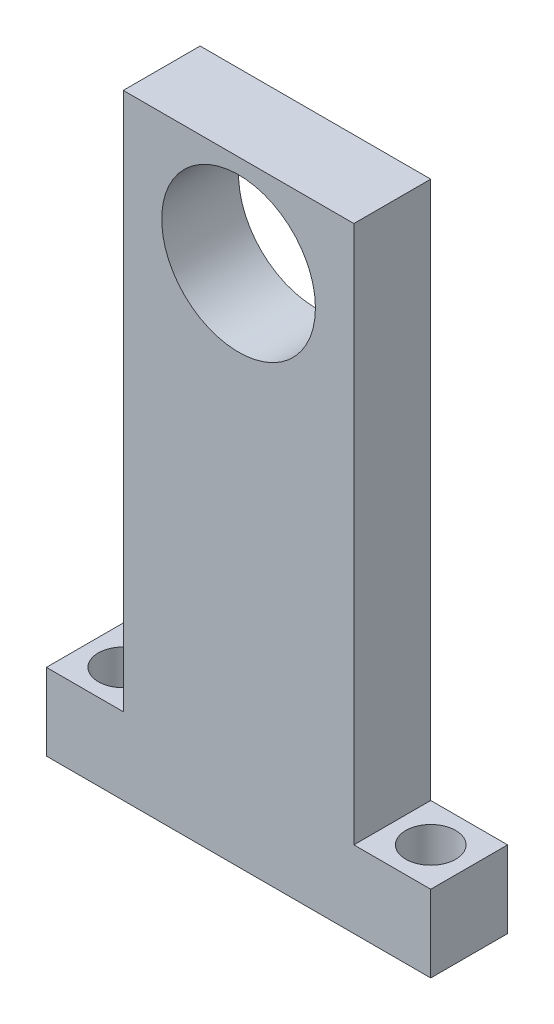
ISO-10303-21;
HEADER;
FILE_DESCRIPTION(('STEP AP214'),'2;1');
FILE_NAME('part.step','',(''),(''),'','','');
FILE_SCHEMA(('AUTOMOTIVE_DESIGN { 1 0 10303 214 1 1 1 1 }'));
ENDSEC;
DATA;
#1=APPLICATION_CONTEXT('core data for automotive mechanical design processes');
#2=APPLICATION_PROTOCOL_DEFINITION('international standard','automotive_design',2000,#1);
#3=PRODUCT_CONTEXT('',#1,'mechanical');
#4=PRODUCT('Part','Part','',(#3));
#5=PRODUCT_RELATED_PRODUCT_CATEGORY('part','',(#4));
#6=PRODUCT_DEFINITION_FORMATION('','',#4);
#7=PRODUCT_DEFINITION_CONTEXT('part definition',#1,'design');
#8=PRODUCT_DEFINITION('design','',#6,#7);
#9=PRODUCT_DEFINITION_SHAPE('','',#8);
#10=(LENGTH_UNIT() NAMED_UNIT(*) SI_UNIT(.MILLI.,.METRE.));
#11=(NAMED_UNIT(*) PLANE_ANGLE_UNIT() SI_UNIT($,.RADIAN.));
#12=(NAMED_UNIT(*) SI_UNIT($,.STERADIAN.) SOLID_ANGLE_UNIT());
#13=UNCERTAINTY_MEASURE_WITH_UNIT(LENGTH_MEASURE(1.E-05),#10,'distance_accuracy_value','');
#14=(GEOMETRIC_REPRESENTATION_CONTEXT(3) GLOBAL_UNCERTAINTY_ASSIGNED_CONTEXT((#13)) GLOBAL_UNIT_ASSIGNED_CONTEXT((#10,
#11,#12)) REPRESENTATION_CONTEXT('',''));
#15=CARTESIAN_POINT('',(0.,0.,0.));
#16=DIRECTION('',(0.,0.,1.));
#17=DIRECTION('',(1.,0.,0.));
#18=AXIS2_PLACEMENT_3D('',#15,#16,#17);
#19=CARTESIAN_POINT('',(-15.,40.,5.));
#20=DIRECTION('',(1.,0.,0.));
#21=DIRECTION('',(0.,0.,-1.));
#22=AXIS2_PLACEMENT_3D('',#19,#20,#21);
#23=PLANE('',#22);
#24=DIRECTION('',(0.,0.,-1.));
#25=VECTOR('',#24,1.);
#26=CARTESIAN_POINT('',(-15.,-30.,5.));
#27=LINE('',#26,#25);
#28=CARTESIAN_POINT('',(-15.,-30.,5.));
#29=VERTEX_POINT('',#28);
#30=CARTESIAN_POINT('',(-15.,-30.,-5.));
#31=VERTEX_POINT('',#30);
#32=EDGE_CURVE('E48',#29,#31,#27,.T.);
#33=ORIENTED_EDGE('',*,*,#32,.F.);
#34=DIRECTION('',(0.,-1.,0.));
#35=VECTOR('',#34,1.);
#36=CARTESIAN_POINT('',(-15.,40.,5.));
#37=LINE('',#36,#35);
#38=CARTESIAN_POINT('',(-15.,40.,5.));
#39=VERTEX_POINT('',#38);
#40=EDGE_CURVE('E123',#39,#29,#37,.T.);
#41=ORIENTED_EDGE('',*,*,#40,.F.);
#42=DIRECTION('',(0.,0.,-1.));
#43=VECTOR('',#42,1.);
#44=CARTESIAN_POINT('',(-15.,40.,5.));
#45=LINE('',#44,#43);
#46=CARTESIAN_POINT('',(-15.,40.,-5.));
#47=VERTEX_POINT('',#46);
#48=EDGE_CURVE('E41',#39,#47,#45,.T.);
#49=ORIENTED_EDGE('',*,*,#48,.T.);
#50=DIRECTION('',(0.,-1.,0.));
#51=VECTOR('',#50,1.);
#52=CARTESIAN_POINT('',(-15.,40.,-5.));
#53=LINE('',#52,#51);
#54=EDGE_CURVE('E174',#47,#31,#53,.T.);
#55=ORIENTED_EDGE('',*,*,#54,.T.);
#56=EDGE_LOOP('',(#33,#41,#49,#55));
#57=FACE_BOUND('',#56,.T.);
#58=ADVANCED_FACE('F33',(#57),#23,.F.);
#59=CARTESIAN_POINT('',(0.,0.,5.));
#60=DIRECTION('',(0.,0.,1.));
#61=DIRECTION('',(1.,0.,0.));
#62=AXIS2_PLACEMENT_3D('',#59,#60,#61);
#63=PLANE('',#62);
#64=DIRECTION('',(1.,0.,0.));
#65=VECTOR('',#64,1.);
#66=CARTESIAN_POINT('',(-15.,-40.,5.));
#67=LINE('',#66,#65);
#68=CARTESIAN_POINT('',(-25.,-40.,5.));
#69=VERTEX_POINT('',#68);
#70=CARTESIAN_POINT('',(25.,-40.,5.));
#71=VERTEX_POINT('',#70);
#72=EDGE_CURVE('E169',#69,#71,#67,.T.);
#73=ORIENTED_EDGE('',*,*,#72,.T.);
#74=DIRECTION('',(0.,-1.,0.));
#75=VECTOR('',#74,1.);
#76=CARTESIAN_POINT('',(25.,-30.,5.));
#77=LINE('',#76,#75);
#78=CARTESIAN_POINT('',(25.,-30.,5.));
#79=VERTEX_POINT('',#78);
#80=EDGE_CURVE('E151',#79,#71,#77,.T.);
#81=ORIENTED_EDGE('',*,*,#80,.F.);
#82=DIRECTION('',(-1.,0.,0.));
#83=VECTOR('',#82,1.);
#84=CARTESIAN_POINT('',(15.,-30.,5.));
#85=LINE('',#84,#83);
#86=CARTESIAN_POINT('',(15.,-30.,5.));
#87=VERTEX_POINT('',#86);
#88=EDGE_CURVE('E145',#79,#87,#85,.T.);
#89=ORIENTED_EDGE('',*,*,#88,.T.);
#90=DIRECTION('',(0.,1.,0.));
#91=VECTOR('',#90,1.);
#92=CARTESIAN_POINT('',(15.,40.,5.));
#93=LINE('',#92,#91);
#94=CARTESIAN_POINT('',(15.,40.,5.));
#95=VERTEX_POINT('',#94);
#96=EDGE_CURVE('E163',#87,#95,#93,.T.);
#97=ORIENTED_EDGE('',*,*,#96,.T.);
#98=DIRECTION('',(-1.,0.,0.));
#99=VECTOR('',#98,1.);
#100=CARTESIAN_POINT('',(-15.,40.,5.));
#101=LINE('',#100,#99);
#102=EDGE_CURVE('E165',#95,#39,#101,.T.);
#103=ORIENTED_EDGE('',*,*,#102,.T.);
#104=ORIENTED_EDGE('',*,*,#40,.T.);
#105=DIRECTION('',(1.,0.,0.));
#106=VECTOR('',#105,1.);
#107=CARTESIAN_POINT('',(-15.,-30.,5.));
#108=LINE('',#107,#106);
#109=CARTESIAN_POINT('',(-25.,-30.,5.));
#110=VERTEX_POINT('',#109);
#111=EDGE_CURVE('E105',#110,#29,#108,.T.);
#112=ORIENTED_EDGE('',*,*,#111,.F.);
#113=DIRECTION('',(0.,-1.,0.));
#114=VECTOR('',#113,1.);
#115=CARTESIAN_POINT('',(-25.,-30.,5.));
#116=LINE('',#115,#114);
#117=EDGE_CURVE('E114',#110,#69,#116,.T.);
#118=ORIENTED_EDGE('',*,*,#117,.T.);
#119=EDGE_LOOP('',(#73,#81,#89,#97,#103,#104,#112,#118));
#120=FACE_BOUND('',#119,.T.);
#121=CARTESIAN_POINT('',(0.,28.,5.));
#122=DIRECTION('',(0.,0.,1.));
#123=DIRECTION('',(1.,0.,0.));
#124=AXIS2_PLACEMENT_3D('',#121,#122,#123);
#125=CIRCLE('',#124,10.);
#126=CARTESIAN_POINT('',(10.,28.,5.));
#127=VERTEX_POINT('',#126);
#128=EDGE_CURVE('E157',#127,#127,#125,.T.);
#129=ORIENTED_EDGE('',*,*,#128,.F.);
#130=EDGE_LOOP('',(#129));
#131=FACE_BOUND('',#130,.T.);
#132=ADVANCED_FACE('F121',(#120,#131),#63,.T.);
#133=CARTESIAN_POINT('',(0.,0.,-5.));
#134=DIRECTION('',(0.,0.,1.));
#135=DIRECTION('',(1.,0.,0.));
#136=AXIS2_PLACEMENT_3D('',#133,#134,#135);
#137=PLANE('',#136);
#138=DIRECTION('',(0.,1.,0.));
#139=VECTOR('',#138,1.);
#140=CARTESIAN_POINT('',(15.,40.,-5.));
#141=LINE('',#140,#139);
#142=CARTESIAN_POINT('',(15.,-30.,-5.));
#143=VERTEX_POINT('',#142);
#144=CARTESIAN_POINT('',(15.,40.,-5.));
#145=VERTEX_POINT('',#144);
#146=EDGE_CURVE('E160',#143,#145,#141,.T.);
#147=ORIENTED_EDGE('',*,*,#146,.F.);
#148=DIRECTION('',(1.,0.,0.));
#149=VECTOR('',#148,1.);
#150=CARTESIAN_POINT('',(15.,-30.,-5.));
#151=LINE('',#150,#149);
#152=CARTESIAN_POINT('',(25.,-30.,-5.));
#153=VERTEX_POINT('',#152);
#154=EDGE_CURVE('E56',#143,#153,#151,.T.);
#155=ORIENTED_EDGE('',*,*,#154,.T.);
#156=DIRECTION('',(0.,-1.,0.));
#157=VECTOR('',#156,1.);
#158=CARTESIAN_POINT('',(25.,-30.,-5.));
#159=LINE('',#158,#157);
#160=CARTESIAN_POINT('',(25.,-40.,-5.));
#161=VERTEX_POINT('',#160);
#162=EDGE_CURVE('E148',#153,#161,#159,.T.);
#163=ORIENTED_EDGE('',*,*,#162,.T.);
#164=DIRECTION('',(1.,0.,0.));
#165=VECTOR('',#164,1.);
#166=CARTESIAN_POINT('',(-15.,-40.,-5.));
#167=LINE('',#166,#165);
#168=CARTESIAN_POINT('',(-25.,-40.,-5.));
#169=VERTEX_POINT('',#168);
#170=EDGE_CURVE('E166',#169,#161,#167,.T.);
#171=ORIENTED_EDGE('',*,*,#170,.F.);
#172=DIRECTION('',(0.,-1.,0.));
#173=VECTOR('',#172,1.);
#174=CARTESIAN_POINT('',(-25.,-30.,-5.));
#175=LINE('',#174,#173);
#176=CARTESIAN_POINT('',(-25.,-30.,-5.));
#177=VERTEX_POINT('',#176);
#178=EDGE_CURVE('E119',#177,#169,#175,.T.);
#179=ORIENTED_EDGE('',*,*,#178,.F.);
#180=DIRECTION('',(-1.,0.,0.));
#181=VECTOR('',#180,1.);
#182=CARTESIAN_POINT('',(-15.,-30.,-5.));
#183=LINE('',#182,#181);
#184=EDGE_CURVE('E107',#31,#177,#183,.T.);
#185=ORIENTED_EDGE('',*,*,#184,.F.);
#186=ORIENTED_EDGE('',*,*,#54,.F.);
#187=DIRECTION('',(-1.,0.,0.));
#188=VECTOR('',#187,1.);
#189=CARTESIAN_POINT('',(-15.,40.,-5.));
#190=LINE('',#189,#188);
#191=EDGE_CURVE('E172',#145,#47,#190,.T.);
#192=ORIENTED_EDGE('',*,*,#191,.F.);
#193=EDGE_LOOP('',(#147,#155,#163,#171,#179,#185,#186,#192));
#194=FACE_BOUND('',#193,.T.);
#195=CARTESIAN_POINT('',(0.,28.,-5.));
#196=DIRECTION('',(0.,0.,1.));
#197=DIRECTION('',(1.,0.,0.));
#198=AXIS2_PLACEMENT_3D('',#195,#196,#197);
#199=CIRCLE('',#198,10.);
#200=CARTESIAN_POINT('',(10.,28.,-5.));
#201=VERTEX_POINT('',#200);
#202=EDGE_CURVE('E154',#201,#201,#199,.T.);
#203=ORIENTED_EDGE('',*,*,#202,.T.);
#204=EDGE_LOOP('',(#203));
#205=FACE_BOUND('',#204,.T.);
#206=ADVANCED_FACE('F184',(#194,#205),#137,.F.);
#207=CARTESIAN_POINT('',(15.,40.,5.));
#208=DIRECTION('',(-1.,0.,0.));
#209=DIRECTION('',(0.,0.,1.));
#210=AXIS2_PLACEMENT_3D('',#207,#208,#209);
#211=PLANE('',#210);
#212=ORIENTED_EDGE('',*,*,#96,.F.);
#213=DIRECTION('',(0.,0.,-1.));
#214=VECTOR('',#213,1.);
#215=CARTESIAN_POINT('',(15.,-30.,5.));
#216=LINE('',#215,#214);
#217=EDGE_CURVE('E139',#87,#143,#216,.T.);
#218=ORIENTED_EDGE('',*,*,#217,.T.);
#219=ORIENTED_EDGE('',*,*,#146,.T.);
#220=DIRECTION('',(0.,0.,-1.));
#221=VECTOR('',#220,1.);
#222=CARTESIAN_POINT('',(15.,40.,5.));
#223=LINE('',#222,#221);
#224=EDGE_CURVE('E11',#95,#145,#223,.T.);
#225=ORIENTED_EDGE('',*,*,#224,.F.);
#226=EDGE_LOOP('',(#212,#218,#219,#225));
#227=FACE_BOUND('',#226,.T.);
#228=ADVANCED_FACE('F35',(#227),#211,.F.);
#229=CARTESIAN_POINT('',(-15.,40.,5.));
#230=DIRECTION('',(0.,-1.,0.));
#231=DIRECTION('',(0.,0.,-1.));
#232=AXIS2_PLACEMENT_3D('',#229,#230,#231);
#233=PLANE('',#232);
#234=ORIENTED_EDGE('',*,*,#191,.T.);
#235=ORIENTED_EDGE('',*,*,#48,.F.);
#236=ORIENTED_EDGE('',*,*,#102,.F.);
#237=ORIENTED_EDGE('',*,*,#224,.T.);
#238=EDGE_LOOP('',(#234,#235,#236,#237));
#239=FACE_BOUND('',#238,.T.);
#240=ADVANCED_FACE('F197',(#239),#233,.F.);
#241=CARTESIAN_POINT('',(-15.,-40.,5.));
#242=DIRECTION('',(0.,1.,0.));
#243=DIRECTION('',(0.,0.,1.));
#244=AXIS2_PLACEMENT_3D('',#241,#242,#243);
#245=PLANE('',#244);
#246=ORIENTED_EDGE('',*,*,#170,.T.);
#247=DIRECTION('',(0.,0.,1.));
#248=VECTOR('',#247,1.);
#249=CARTESIAN_POINT('',(25.,-40.,5.));
#250=LINE('',#249,#248);
#251=EDGE_CURVE('E136',#161,#71,#250,.T.);
#252=ORIENTED_EDGE('',*,*,#251,.T.);
#253=ORIENTED_EDGE('',*,*,#72,.F.);
#254=DIRECTION('',(0.,0.,1.));
#255=VECTOR('',#254,1.);
#256=CARTESIAN_POINT('',(-25.,-40.,5.));
#257=LINE('',#256,#255);
#258=EDGE_CURVE('E117',#169,#69,#257,.T.);
#259=ORIENTED_EDGE('',*,*,#258,.F.);
#260=EDGE_LOOP('',(#246,#252,#253,#259));
#261=FACE_BOUND('',#260,.T.);
#262=CARTESIAN_POINT('',(20.,-40.,0.));
#263=DIRECTION('',(0.,-1.,0.));
#264=DIRECTION('',(0.,0.,-1.));
#265=AXIS2_PLACEMENT_3D('',#262,#263,#264);
#266=CIRCLE('',#265,3.25);
#267=CARTESIAN_POINT('',(20.,-40.,-3.25));
#268=VERTEX_POINT('',#267);
#269=EDGE_CURVE('E131',#268,#268,#266,.T.);
#270=ORIENTED_EDGE('',*,*,#269,.F.);
#271=EDGE_LOOP('',(#270));
#272=FACE_BOUND('',#271,.T.);
#273=CARTESIAN_POINT('',(-20.,-40.,0.));
#274=DIRECTION('',(0.,1.,0.));
#275=DIRECTION('',(0.,0.,-1.));
#276=AXIS2_PLACEMENT_3D('',#273,#274,#275);
#277=CIRCLE('',#276,3.25);
#278=CARTESIAN_POINT('',(-20.,-40.,-3.25));
#279=VERTEX_POINT('',#278);
#280=EDGE_CURVE('E240',#279,#279,#277,.T.);
#281=ORIENTED_EDGE('',*,*,#280,.T.);
#282=EDGE_LOOP('',(#281));
#283=FACE_BOUND('',#282,.T.);
#284=ADVANCED_FACE('F187',(#261,#272,#283),#245,.F.);
#285=CARTESIAN_POINT('',(0.,28.,5.));
#286=DIRECTION('',(0.,0.,-1.));
#287=DIRECTION('',(-1.,0.,0.));
#288=AXIS2_PLACEMENT_3D('',#285,#286,#287);
#289=CYLINDRICAL_SURFACE('',#288,10.);
#290=ORIENTED_EDGE('',*,*,#128,.T.);
#291=EDGE_LOOP('',(#290));
#292=FACE_BOUND('',#291,.T.);
#293=ORIENTED_EDGE('',*,*,#202,.F.);
#294=EDGE_LOOP('',(#293));
#295=FACE_BOUND('',#294,.T.);
#296=ADVANCED_FACE('F203',(#292,#295),#289,.F.);
#297=CARTESIAN_POINT('',(25.,-30.,5.));
#298=DIRECTION('',(1.,0.,0.));
#299=DIRECTION('',(0.,0.,-1.));
#300=AXIS2_PLACEMENT_3D('',#297,#298,#299);
#301=PLANE('',#300);
#302=ORIENTED_EDGE('',*,*,#251,.F.);
#303=ORIENTED_EDGE('',*,*,#162,.F.);
#304=DIRECTION('',(0.,0.,1.));
#305=VECTOR('',#304,1.);
#306=CARTESIAN_POINT('',(25.,-30.,5.));
#307=LINE('',#306,#305);
#308=EDGE_CURVE('E142',#153,#79,#307,.T.);
#309=ORIENTED_EDGE('',*,*,#308,.T.);
#310=ORIENTED_EDGE('',*,*,#80,.T.);
#311=EDGE_LOOP('',(#302,#303,#309,#310));
#312=FACE_BOUND('',#311,.T.);
#313=ADVANCED_FACE('F191',(#312),#301,.T.);
#314=CARTESIAN_POINT('',(0.,-30.,0.));
#315=DIRECTION('',(0.,-1.,0.));
#316=DIRECTION('',(0.,0.,-1.));
#317=AXIS2_PLACEMENT_3D('',#314,#315,#316);
#318=PLANE('',#317);
#319=CARTESIAN_POINT('',(20.,-30.,0.));
#320=DIRECTION('',(0.,-1.,0.));
#321=DIRECTION('',(0.,0.,-1.));
#322=AXIS2_PLACEMENT_3D('',#319,#320,#321);
#323=CIRCLE('',#322,3.25);
#324=CARTESIAN_POINT('',(20.,-30.,-3.25));
#325=VERTEX_POINT('',#324);
#326=EDGE_CURVE('E133',#325,#325,#323,.T.);
#327=ORIENTED_EDGE('',*,*,#326,.T.);
#328=EDGE_LOOP('',(#327));
#329=FACE_BOUND('',#328,.T.);
#330=ORIENTED_EDGE('',*,*,#217,.F.);
#331=ORIENTED_EDGE('',*,*,#88,.F.);
#332=ORIENTED_EDGE('',*,*,#308,.F.);
#333=ORIENTED_EDGE('',*,*,#154,.F.);
#334=EDGE_LOOP('',(#330,#331,#332,#333));
#335=FACE_BOUND('',#334,.T.);
#336=ADVANCED_FACE('F193',(#329,#335),#318,.F.);
#337=CARTESIAN_POINT('',(20.,-30.,0.));
#338=DIRECTION('',(0.,-1.,0.));
#339=DIRECTION('',(0.,0.,-1.));
#340=AXIS2_PLACEMENT_3D('',#337,#338,#339);
#341=CYLINDRICAL_SURFACE('',#340,3.25);
#342=ORIENTED_EDGE('',*,*,#326,.F.);
#343=EDGE_LOOP('',(#342));
#344=FACE_BOUND('',#343,.T.);
#345=ORIENTED_EDGE('',*,*,#269,.T.);
#346=EDGE_LOOP('',(#345));
#347=FACE_BOUND('',#346,.T.);
#348=ADVANCED_FACE('F221',(#344,#347),#341,.F.);
#349=CARTESIAN_POINT('',(0.,-30.,0.));
#350=DIRECTION('',(0.,-1.,0.));
#351=DIRECTION('',(0.,0.,-1.));
#352=AXIS2_PLACEMENT_3D('',#349,#350,#351);
#353=PLANE('',#352);
#354=ORIENTED_EDGE('',*,*,#32,.T.);
#355=ORIENTED_EDGE('',*,*,#184,.T.);
#356=DIRECTION('',(0.,0.,1.));
#357=VECTOR('',#356,1.);
#358=CARTESIAN_POINT('',(-25.,-30.,5.));
#359=LINE('',#358,#357);
#360=EDGE_CURVE('E100',#177,#110,#359,.T.);
#361=ORIENTED_EDGE('',*,*,#360,.T.);
#362=ORIENTED_EDGE('',*,*,#111,.T.);
#363=EDGE_LOOP('',(#354,#355,#361,#362));
#364=FACE_BOUND('',#363,.T.);
#365=CARTESIAN_POINT('',(-20.,-30.,0.));
#366=DIRECTION('',(0.,1.,0.));
#367=DIRECTION('',(0.,0.,-1.));
#368=AXIS2_PLACEMENT_3D('',#365,#366,#367);
#369=CIRCLE('',#368,3.25);
#370=CARTESIAN_POINT('',(-20.,-30.,-3.25));
#371=VERTEX_POINT('',#370);
#372=EDGE_CURVE('E130',#371,#371,#369,.T.);
#373=ORIENTED_EDGE('',*,*,#372,.F.);
#374=EDGE_LOOP('',(#373));
#375=FACE_BOUND('',#374,.T.);
#376=ADVANCED_FACE('F102',(#364,#375),#353,.F.);
#377=CARTESIAN_POINT('',(-25.,-30.,5.));
#378=DIRECTION('',(1.,0.,0.));
#379=DIRECTION('',(0.,0.,-1.));
#380=AXIS2_PLACEMENT_3D('',#377,#378,#379);
#381=PLANE('',#380);
#382=ORIENTED_EDGE('',*,*,#258,.T.);
#383=ORIENTED_EDGE('',*,*,#117,.F.);
#384=ORIENTED_EDGE('',*,*,#360,.F.);
#385=ORIENTED_EDGE('',*,*,#178,.T.);
#386=EDGE_LOOP('',(#382,#383,#384,#385));
#387=FACE_BOUND('',#386,.T.);
#388=ADVANCED_FACE('F115',(#387),#381,.F.);
#389=CARTESIAN_POINT('',(-20.,-30.,0.));
#390=DIRECTION('',(0.,-1.,0.));
#391=DIRECTION('',(0.,0.,-1.));
#392=AXIS2_PLACEMENT_3D('',#389,#390,#391);
#393=CYLINDRICAL_SURFACE('',#392,3.25);
#394=ORIENTED_EDGE('',*,*,#372,.T.);
#395=EDGE_LOOP('',(#394));
#396=FACE_BOUND('',#395,.T.);
#397=ORIENTED_EDGE('',*,*,#280,.F.);
#398=EDGE_LOOP('',(#397));
#399=FACE_BOUND('',#398,.T.);
#400=ADVANCED_FACE('F228',(#396,#399),#393,.F.);
#401=CLOSED_SHELL('',(#58,#132,#206,#228,#240,#284,#296,#313,#336,#348,#376,#388,#400));
#402=MANIFOLD_SOLID_BREP('B2',#401);
#403=ADVANCED_BREP_SHAPE_REPRESENTATION('',(#18,#402),#14);
#404=SHAPE_DEFINITION_REPRESENTATION(#9,#403);
ENDSEC;
END-ISO-10303-21;
